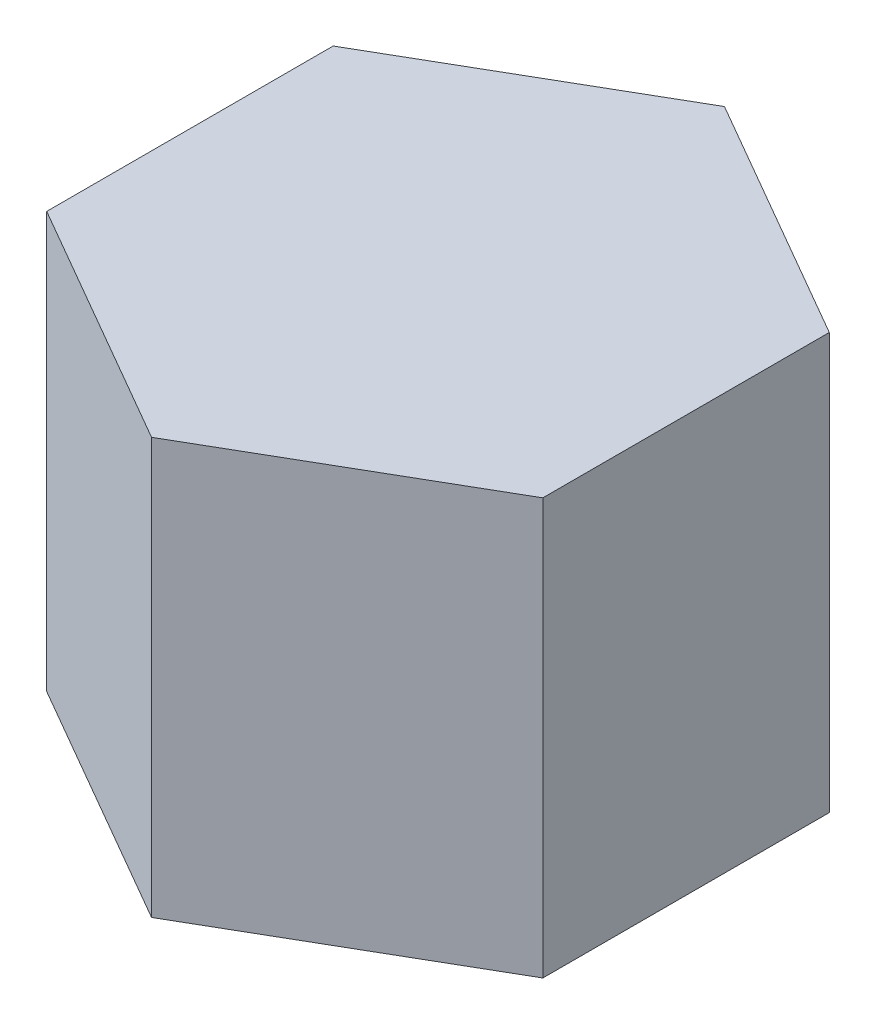
ISO-10303-21;
HEADER;
FILE_DESCRIPTION(('STEP AP214'),'2;1');
FILE_NAME('part.step','',(''),(''),'','','');
FILE_SCHEMA(('AUTOMOTIVE_DESIGN { 1 0 10303 214 1 1 1 1 }'));
ENDSEC;
DATA;
#1=APPLICATION_CONTEXT('core data for automotive mechanical design processes');
#2=APPLICATION_PROTOCOL_DEFINITION('international standard','automotive_design',2000,#1);
#3=PRODUCT_CONTEXT('',#1,'mechanical');
#4=PRODUCT('Part','Part','',(#3));
#5=PRODUCT_RELATED_PRODUCT_CATEGORY('part','',(#4));
#6=PRODUCT_DEFINITION_FORMATION('','',#4);
#7=PRODUCT_DEFINITION_CONTEXT('part definition',#1,'design');
#8=PRODUCT_DEFINITION('design','',#6,#7);
#9=PRODUCT_DEFINITION_SHAPE('','',#8);
#10=(LENGTH_UNIT() NAMED_UNIT(*) SI_UNIT(.MILLI.,.METRE.));
#11=(NAMED_UNIT(*) PLANE_ANGLE_UNIT() SI_UNIT($,.RADIAN.));
#12=(NAMED_UNIT(*) SI_UNIT($,.STERADIAN.) SOLID_ANGLE_UNIT());
#13=UNCERTAINTY_MEASURE_WITH_UNIT(LENGTH_MEASURE(1.E-05),#10,'distance_accuracy_value','');
#14=(GEOMETRIC_REPRESENTATION_CONTEXT(3) GLOBAL_UNCERTAINTY_ASSIGNED_CONTEXT((#13)) GLOBAL_UNIT_ASSIGNED_CONTEXT((#10,
#11,#12)) REPRESENTATION_CONTEXT('',''));
#15=CARTESIAN_POINT('',(0.,0.,0.));
#16=DIRECTION('',(0.,0.,1.));
#17=DIRECTION('',(1.,0.,0.));
#18=AXIS2_PLACEMENT_3D('',#15,#16,#17);
#19=CARTESIAN_POINT('',(208.142660308706,-148.537700895744,294.105047431848));
#20=DIRECTION('',(-0.499999999999909,0.,-0.866025403784491));
#21=DIRECTION('',(-0.866025403784491,0.,0.499999999999909));
#22=AXIS2_PLACEMENT_3D('',#19,#20,#21);
#23=PLANE('',#22);
#24=CARTESIAN_POINT('',(207.839551417381,-149.045793579175,294.280047431848));
#25=DIRECTION('',(0.866025403784491,0.,-0.499999999999909));
#26=VECTOR('',#25,1.);
#27=LINE('',#24,#26);
#28=CARTESIAN_POINT('',(207.839551417382,-149.045793579175,294.280047431848));
#29=VERTEX_POINT('',#28);
#30=CARTESIAN_POINT('',(208.142660308706,-149.045793579175,294.105047431848));
#31=VERTEX_POINT('',#30);
#32=EDGE_CURVE('E170',#29,#31,#27,.T.);
#33=ORIENTED_EDGE('',*,*,#32,.T.);
#34=CARTESIAN_POINT('',(208.142660308706,-148.537700895744,294.105047431848));
#35=DIRECTION('',(0.,-1.,0.));
#36=VECTOR('',#35,1.);
#37=LINE('',#34,#36);
#38=CARTESIAN_POINT('',(208.142660308706,-148.537700895744,294.105047431848));
#39=VERTEX_POINT('',#38);
#40=EDGE_CURVE('E35',#39,#31,#37,.T.);
#41=ORIENTED_EDGE('',*,*,#40,.F.);
#42=CARTESIAN_POINT('',(207.839551417381,-148.537700895744,294.280047431848));
#43=DIRECTION('',(0.866025403784491,0.,-0.499999999999909));
#44=VECTOR('',#43,1.);
#45=LINE('',#42,#44);
#46=CARTESIAN_POINT('',(207.839551417382,-148.537700895744,294.280047431848));
#47=VERTEX_POINT('',#46);
#48=EDGE_CURVE('E159',#47,#39,#45,.T.);
#49=ORIENTED_EDGE('',*,*,#48,.F.);
#50=CARTESIAN_POINT('',(207.839551417381,-148.537700895744,294.280047431848));
#51=DIRECTION('',(0.,-1.,0.));
#52=VECTOR('',#51,1.);
#53=LINE('',#50,#52);
#54=EDGE_CURVE('E10',#47,#29,#53,.T.);
#55=ORIENTED_EDGE('',*,*,#54,.T.);
#56=EDGE_LOOP('',(#33,#41,#49,#55));
#57=FACE_BOUND('',#56,.T.);
#58=ADVANCED_FACE('F16',(#57),#23,.F.);
#59=CARTESIAN_POINT('',(207.839551417382,-148.537700895744,294.280047431848));
#60=DIRECTION('',(0.500000000000062,0.,-0.866025403784403));
#61=DIRECTION('',(-0.866025403784403,0.,-0.500000000000062));
#62=AXIS2_PLACEMENT_3D('',#59,#60,#61);
#63=PLANE('',#62);
#64=CARTESIAN_POINT('',(207.536442526057,-149.045793579175,294.105047431848));
#65=DIRECTION('',(0.866025403784403,0.,0.500000000000062));
#66=VECTOR('',#65,1.);
#67=LINE('',#64,#66);
#68=CARTESIAN_POINT('',(207.536442526057,-149.045793579175,294.105047431848));
#69=VERTEX_POINT('',#68);
#70=EDGE_CURVE('E167',#69,#29,#67,.T.);
#71=ORIENTED_EDGE('',*,*,#70,.T.);
#72=ORIENTED_EDGE('',*,*,#54,.F.);
#73=CARTESIAN_POINT('',(207.536442526057,-148.537700895744,294.105047431848));
#74=DIRECTION('',(0.866025403784403,0.,0.500000000000062));
#75=VECTOR('',#74,1.);
#76=LINE('',#73,#75);
#77=CARTESIAN_POINT('',(207.536442526057,-148.537700895744,294.105047431848));
#78=VERTEX_POINT('',#77);
#79=EDGE_CURVE('E156',#78,#47,#76,.T.);
#80=ORIENTED_EDGE('',*,*,#79,.F.);
#81=CARTESIAN_POINT('',(207.536442526057,-148.537700895744,294.105047431848));
#82=DIRECTION('',(0.,-1.,0.));
#83=VECTOR('',#82,1.);
#84=LINE('',#81,#83);
#85=EDGE_CURVE('E27',#78,#69,#84,.T.);
#86=ORIENTED_EDGE('',*,*,#85,.T.);
#87=EDGE_LOOP('',(#71,#72,#80,#86));
#88=FACE_BOUND('',#87,.T.);
#89=ADVANCED_FACE('F189',(#88),#63,.F.);
#90=CARTESIAN_POINT('',(207.536442526057,-148.537700895744,290.831971220494));
#91=DIRECTION('',(1.,0.,0.));
#92=DIRECTION('',(0.,1.,0.));
#93=AXIS2_PLACEMENT_3D('',#90,#91,#92);
#94=PLANE('',#93);
#95=CARTESIAN_POINT('',(207.536442526057,-149.045793579175,293.755047431848));
#96=DIRECTION('',(0.,0.,1.));
#97=VECTOR('',#96,1.);
#98=LINE('',#95,#97);
#99=CARTESIAN_POINT('',(207.536442526057,-149.045793579175,293.755047431848));
#100=VERTEX_POINT('',#99);
#101=EDGE_CURVE('E163',#100,#69,#98,.T.);
#102=ORIENTED_EDGE('',*,*,#101,.T.);
#103=ORIENTED_EDGE('',*,*,#85,.F.);
#104=CARTESIAN_POINT('',(207.536442526057,-148.537700895744,293.755047431848));
#105=DIRECTION('',(0.,0.,1.));
#106=VECTOR('',#105,1.);
#107=LINE('',#104,#106);
#108=CARTESIAN_POINT('',(207.536442526057,-148.537700895744,293.755047431848));
#109=VERTEX_POINT('',#108);
#110=EDGE_CURVE('E106',#109,#78,#107,.T.);
#111=ORIENTED_EDGE('',*,*,#110,.F.);
#112=CARTESIAN_POINT('',(207.536442526057,-148.537700895744,293.755047431848));
#113=DIRECTION('',(0.,-1.,0.));
#114=VECTOR('',#113,1.);
#115=LINE('',#112,#114);
#116=EDGE_CURVE('E94',#109,#100,#115,.T.);
#117=ORIENTED_EDGE('',*,*,#116,.T.);
#118=EDGE_LOOP('',(#102,#103,#111,#117));
#119=FACE_BOUND('',#118,.T.);
#120=ADVANCED_FACE('F198',(#119),#94,.F.);
#121=CARTESIAN_POINT('',(207.536442526057,-148.537700895744,293.755047431848));
#122=DIRECTION('',(0.499999999999978,0.,0.866025403784452));
#123=DIRECTION('',(0.866025403784452,0.,-0.499999999999978));
#124=AXIS2_PLACEMENT_3D('',#121,#122,#123);
#125=PLANE('',#124);
#126=CARTESIAN_POINT('',(207.839551417382,-149.045793579175,293.580047431848));
#127=DIRECTION('',(-0.866025403784452,0.,0.499999999999978));
#128=VECTOR('',#127,1.);
#129=LINE('',#126,#128);
#130=CARTESIAN_POINT('',(207.839551417382,-149.045793579175,293.580047431848));
#131=VERTEX_POINT('',#130);
#132=EDGE_CURVE('E162',#131,#100,#129,.T.);
#133=ORIENTED_EDGE('',*,*,#132,.T.);
#134=ORIENTED_EDGE('',*,*,#116,.F.);
#135=CARTESIAN_POINT('',(207.839551417382,-148.537700895744,293.580047431848));
#136=DIRECTION('',(-0.866025403784452,0.,0.499999999999978));
#137=VECTOR('',#136,1.);
#138=LINE('',#135,#137);
#139=CARTESIAN_POINT('',(207.839551417382,-148.537700895744,293.580047431848));
#140=VERTEX_POINT('',#139);
#141=EDGE_CURVE('E98',#140,#109,#138,.T.);
#142=ORIENTED_EDGE('',*,*,#141,.F.);
#143=CARTESIAN_POINT('',(207.839551417382,-148.537700895744,293.580047431848));
#144=DIRECTION('',(0.,-1.,0.));
#145=VECTOR('',#144,1.);
#146=LINE('',#143,#145);
#147=EDGE_CURVE('E79',#140,#131,#146,.T.);
#148=ORIENTED_EDGE('',*,*,#147,.T.);
#149=EDGE_LOOP('',(#133,#134,#142,#148));
#150=FACE_BOUND('',#149,.T.);
#151=ADVANCED_FACE('F100',(#150),#125,.F.);
#152=CARTESIAN_POINT('',(207.839551417382,-148.537700895744,293.580047431848));
#153=DIRECTION('',(-0.500000000000096,0.,0.866025403784383));
#154=DIRECTION('',(0.866025403784383,0.,0.500000000000096));
#155=AXIS2_PLACEMENT_3D('',#152,#153,#154);
#156=PLANE('',#155);
#157=CARTESIAN_POINT('',(208.142660308706,-149.045793579175,293.755047431848));
#158=DIRECTION('',(-0.866025403784383,0.,-0.500000000000096));
#159=VECTOR('',#158,1.);
#160=LINE('',#157,#159);
#161=CARTESIAN_POINT('',(208.142660308706,-149.045793579175,293.755047431848));
#162=VERTEX_POINT('',#161);
#163=EDGE_CURVE('E88',#162,#131,#160,.T.);
#164=ORIENTED_EDGE('',*,*,#163,.T.);
#165=ORIENTED_EDGE('',*,*,#147,.F.);
#166=CARTESIAN_POINT('',(208.142660308706,-148.537700895744,293.755047431848));
#167=DIRECTION('',(-0.866025403784383,0.,-0.500000000000096));
#168=VECTOR('',#167,1.);
#169=LINE('',#166,#168);
#170=CARTESIAN_POINT('',(208.142660308706,-148.537700895744,293.755047431848));
#171=VERTEX_POINT('',#170);
#172=EDGE_CURVE('E84',#171,#140,#169,.T.);
#173=ORIENTED_EDGE('',*,*,#172,.F.);
#174=CARTESIAN_POINT('',(208.142660308706,-148.537700895744,293.755047431848));
#175=DIRECTION('',(0.,-1.,0.));
#176=VECTOR('',#175,1.);
#177=LINE('',#174,#176);
#178=EDGE_CURVE('E58',#171,#162,#177,.T.);
#179=ORIENTED_EDGE('',*,*,#178,.T.);
#180=EDGE_LOOP('',(#164,#165,#173,#179));
#181=FACE_BOUND('',#180,.T.);
#182=ADVANCED_FACE('F82',(#181),#156,.F.);
#183=CARTESIAN_POINT('',(208.142660308706,-148.537700895744,290.831971220494));
#184=DIRECTION('',(-1.,0.,0.));
#185=DIRECTION('',(0.,-1.,0.));
#186=AXIS2_PLACEMENT_3D('',#183,#184,#185);
#187=PLANE('',#186);
#188=CARTESIAN_POINT('',(208.142660308706,-149.045793579175,294.105047431848));
#189=DIRECTION('',(0.,0.,-1.));
#190=VECTOR('',#189,1.);
#191=LINE('',#188,#190);
#192=EDGE_CURVE('E160',#31,#162,#191,.T.);
#193=ORIENTED_EDGE('',*,*,#192,.T.);
#194=ORIENTED_EDGE('',*,*,#178,.F.);
#195=CARTESIAN_POINT('',(208.142660308706,-148.537700895744,294.105047431848));
#196=DIRECTION('',(0.,0.,-1.));
#197=VECTOR('',#196,1.);
#198=LINE('',#195,#197);
#199=EDGE_CURVE('E112',#39,#171,#198,.T.);
#200=ORIENTED_EDGE('',*,*,#199,.F.);
#201=ORIENTED_EDGE('',*,*,#40,.T.);
#202=EDGE_LOOP('',(#193,#194,#200,#201));
#203=FACE_BOUND('',#202,.T.);
#204=ADVANCED_FACE('F131',(#203),#187,.F.);
#205=CARTESIAN_POINT('',(206.339551417382,-148.537700895744,290.831971220494));
#206=DIRECTION('',(0.,-1.,0.));
#207=DIRECTION('',(1.,0.,0.));
#208=AXIS2_PLACEMENT_3D('',#205,#206,#207);
#209=PLANE('',#208);
#210=ORIENTED_EDGE('',*,*,#48,.T.);
#211=ORIENTED_EDGE('',*,*,#199,.T.);
#212=ORIENTED_EDGE('',*,*,#172,.T.);
#213=ORIENTED_EDGE('',*,*,#141,.T.);
#214=ORIENTED_EDGE('',*,*,#110,.T.);
#215=ORIENTED_EDGE('',*,*,#79,.T.);
#216=EDGE_LOOP('',(#210,#211,#212,#213,#214,#215));
#217=FACE_BOUND('',#216,.T.);
#218=ADVANCED_FACE('F111',(#217),#209,.F.);
#219=CARTESIAN_POINT('',(206.339551417382,-149.045793579175,290.831971220494));
#220=DIRECTION('',(0.,-1.,0.));
#221=DIRECTION('',(1.,0.,0.));
#222=AXIS2_PLACEMENT_3D('',#219,#220,#221);
#223=PLANE('',#222);
#224=ORIENTED_EDGE('',*,*,#32,.F.);
#225=ORIENTED_EDGE('',*,*,#70,.F.);
#226=ORIENTED_EDGE('',*,*,#101,.F.);
#227=ORIENTED_EDGE('',*,*,#132,.F.);
#228=ORIENTED_EDGE('',*,*,#163,.F.);
#229=ORIENTED_EDGE('',*,*,#192,.F.);
#230=EDGE_LOOP('',(#224,#225,#226,#227,#228,#229));
#231=FACE_BOUND('',#230,.T.);
#232=ADVANCED_FACE('F130',(#231),#223,.T.);
#233=CLOSED_SHELL('',(#58,#89,#120,#151,#182,#204,#218,#232));
#234=MANIFOLD_SOLID_BREP('B1',#233);
#235=ADVANCED_BREP_SHAPE_REPRESENTATION('',(#18,#234),#14);
#236=SHAPE_DEFINITION_REPRESENTATION(#9,#235);
ENDSEC;
END-ISO-10303-21;
